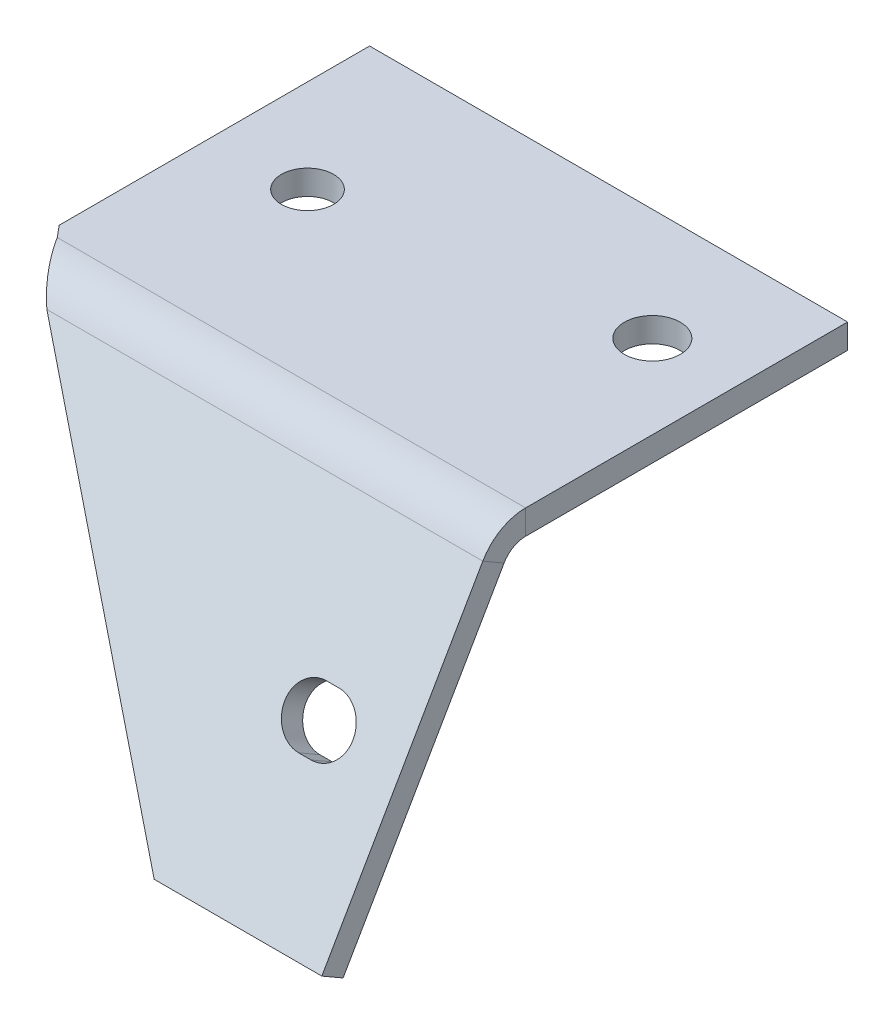
ISO-10303-21;
HEADER;
FILE_DESCRIPTION(('STEP AP214'),'2;1');
FILE_NAME('part.step','',(''),(''),'','','');
FILE_SCHEMA(('AUTOMOTIVE_DESIGN { 1 0 10303 214 1 1 1 1 }'));
ENDSEC;
DATA;
#1=APPLICATION_CONTEXT('core data for automotive mechanical design processes');
#2=APPLICATION_PROTOCOL_DEFINITION('international standard','automotive_design',2000,#1);
#3=PRODUCT_CONTEXT('',#1,'mechanical');
#4=PRODUCT('Part','Part','',(#3));
#5=PRODUCT_RELATED_PRODUCT_CATEGORY('part','',(#4));
#6=PRODUCT_DEFINITION_FORMATION('','',#4);
#7=PRODUCT_DEFINITION_CONTEXT('part definition',#1,'design');
#8=PRODUCT_DEFINITION('design','',#6,#7);
#9=PRODUCT_DEFINITION_SHAPE('','',#8);
#10=(LENGTH_UNIT() NAMED_UNIT(*) SI_UNIT(.MILLI.,.METRE.));
#11=(NAMED_UNIT(*) PLANE_ANGLE_UNIT() SI_UNIT($,.RADIAN.));
#12=(NAMED_UNIT(*) SI_UNIT($,.STERADIAN.) SOLID_ANGLE_UNIT());
#13=UNCERTAINTY_MEASURE_WITH_UNIT(LENGTH_MEASURE(1.E-05),#10,'distance_accuracy_value','');
#14=(GEOMETRIC_REPRESENTATION_CONTEXT(3) GLOBAL_UNCERTAINTY_ASSIGNED_CONTEXT((#13)) GLOBAL_UNIT_ASSIGNED_CONTEXT((#10,
#11,#12)) REPRESENTATION_CONTEXT('',''));
#15=CARTESIAN_POINT('',(0.,0.,0.));
#16=DIRECTION('',(0.,0.,1.));
#17=DIRECTION('',(1.,0.,0.));
#18=AXIS2_PLACEMENT_3D('',#15,#16,#17);
#19=CARTESIAN_POINT('',(0.,12.3561960815317,8.59844059850372));
#20=DIRECTION('',(0.,-0.499999999999998,-0.86602540378444));
#21=DIRECTION('',(0.,0.86602540378444,-0.499999999999998));
#22=AXIS2_PLACEMENT_3D('',#19,#20,#21);
#23=PLANE('',#22);
#24=DIRECTION('',(1.,0.,0.));
#25=VECTOR('',#24,1.);
#26=CARTESIAN_POINT('',(0.,-11.2713846311385,22.2398306832634));
#27=LINE('',#26,#25);
#28=CARTESIAN_POINT('',(12.0250000000008,-11.2713846311385,22.2398306832634));
#29=VERTEX_POINT('',#28);
#30=CARTESIAN_POINT('',(13.0250000000008,-11.2713846311385,22.2398306832634));
#31=VERTEX_POINT('',#30);
#32=EDGE_CURVE('E181',#29,#31,#27,.T.);
#33=ORIENTED_EDGE('',*,*,#32,.T.);
#34=CARTESIAN_POINT('',(13.0250000000008,-13.2199417896535,23.3648306832634));
#35=DIRECTION('',(0.,-0.499999999999998,-0.86602540378444));
#36=DIRECTION('',(0.,0.86602540378444,-0.499999999999998));
#37=AXIS2_PLACEMENT_3D('',#34,#35,#36);
#38=CIRCLE('',#37,2.25);
#39=CARTESIAN_POINT('',(13.0250000000008,-15.1684989481685,24.4898306832634));
#40=VERTEX_POINT('',#39);
#41=EDGE_CURVE('E184',#31,#40,#38,.T.);
#42=ORIENTED_EDGE('',*,*,#41,.T.);
#43=DIRECTION('',(-1.,0.,0.));
#44=VECTOR('',#43,1.);
#45=CARTESIAN_POINT('',(0.,-15.1684989481685,24.4898306832634));
#46=LINE('',#45,#44);
#47=CARTESIAN_POINT('',(12.0250000000008,-15.1684989481685,24.4898306832634));
#48=VERTEX_POINT('',#47);
#49=EDGE_CURVE('E176',#40,#48,#46,.T.);
#50=ORIENTED_EDGE('',*,*,#49,.T.);
#51=CARTESIAN_POINT('',(12.0250000000008,-13.2199417896535,23.3648306832634));
#52=DIRECTION('',(0.,-0.499999999999998,-0.86602540378444));
#53=DIRECTION('',(0.,0.86602540378444,-0.499999999999998));
#54=AXIS2_PLACEMENT_3D('',#51,#52,#53);
#55=CIRCLE('',#54,2.25);
#56=EDGE_CURVE('E156',#48,#29,#55,.T.);
#57=ORIENTED_EDGE('',*,*,#56,.T.);
#58=EDGE_LOOP('',(#33,#42,#50,#57));
#59=FACE_BOUND('',#58,.T.);
#60=DIRECTION('',(0.,0.86602540378444,-0.499999999999998));
#61=VECTOR('',#60,1.);
#62=CARTESIAN_POINT('',(19.25,1.53087853422617,14.8484405985037));
#63=LINE('',#62,#61);
#64=CARTESIAN_POINT('',(19.25,-24.449883579307,29.8484405985036));
#65=VERTEX_POINT('',#64);
#66=CARTESIAN_POINT('',(19.25,-1.99000000000001,16.8812207680231));
#67=VERTEX_POINT('',#66);
#68=EDGE_CURVE('E399',#65,#67,#63,.T.);
#69=ORIENTED_EDGE('',*,*,#68,.T.);
#70=DIRECTION('',(-1.,0.,0.));
#71=VECTOR('',#70,1.);
#72=CARTESIAN_POINT('',(0.,-1.99000000000001,16.8812207680231));
#73=LINE('',#72,#71);
#74=CARTESIAN_POINT('',(-15.8620330508009,-1.99000000000001,16.8812207680231));
#75=VERTEX_POINT('',#74);
#76=EDGE_CURVE('E62',#67,#75,#73,.T.);
#77=ORIENTED_EDGE('',*,*,#76,.T.);
#78=DIRECTION('',(0.64018439966448,-0.665299143859116,0.384110639798686));
#79=VECTOR('',#78,1.);
#80=CARTESIAN_POINT('',(-19.25,1.53087853422617,14.8484405985037));
#81=LINE('',#80,#79);
#82=CARTESIAN_POINT('',(5.75,-24.449883579307,29.8484405985036));
#83=VERTEX_POINT('',#82);
#84=EDGE_CURVE('E288',#75,#83,#81,.T.);
#85=ORIENTED_EDGE('',*,*,#84,.T.);
#86=DIRECTION('',(1.,0.,0.));
#87=VECTOR('',#86,1.);
#88=CARTESIAN_POINT('',(5.75,-24.449883579307,29.8484405985036));
#89=LINE('',#88,#87);
#90=EDGE_CURVE('E387',#83,#65,#89,.T.);
#91=ORIENTED_EDGE('',*,*,#90,.T.);
#92=EDGE_LOOP('',(#69,#77,#85,#91));
#93=FACE_BOUND('',#92,.T.);
#94=ADVANCED_FACE('F53',(#59,#93),#23,.F.);
#95=CARTESIAN_POINT('',(19.25,0.540878534226177,13.1337102990105));
#96=DIRECTION('',(1.,0.,0.));
#97=DIRECTION('',(0.,0.86602540378444,-0.499999999999998));
#98=AXIS2_PLACEMENT_3D('',#95,#96,#97);
#99=PLANE('',#98);
#100=DIRECTION('',(0.,-0.499999999999998,-0.86602540378444));
#101=VECTOR('',#100,1.);
#102=CARTESIAN_POINT('',(19.25,-2.98,15.16649046853));
#103=LINE('',#102,#101);
#104=CARTESIAN_POINT('',(19.25,-2.98,15.16649046853));
#105=VERTEX_POINT('',#104);
#106=EDGE_CURVE('E12',#67,#105,#103,.T.);
#107=ORIENTED_EDGE('',*,*,#106,.F.);
#108=ORIENTED_EDGE('',*,*,#68,.F.);
#109=DIRECTION('',(0.,0.499999999999998,0.86602540378444));
#110=VECTOR('',#109,1.);
#111=CARTESIAN_POINT('',(19.25,-25.439883579307,28.1337102990104));
#112=LINE('',#111,#110);
#113=CARTESIAN_POINT('',(19.25,-25.439883579307,28.1337102990104));
#114=VERTEX_POINT('',#113);
#115=EDGE_CURVE('E393',#114,#65,#112,.T.);
#116=ORIENTED_EDGE('',*,*,#115,.F.);
#117=DIRECTION('',(0.,0.86602540378444,-0.499999999999998));
#118=VECTOR('',#117,1.);
#119=CARTESIAN_POINT('',(19.25,-25.439883579307,28.1337102990104));
#120=LINE('',#119,#118);
#121=EDGE_CURVE('E401',#114,#105,#120,.T.);
#122=ORIENTED_EDGE('',*,*,#121,.T.);
#123=EDGE_LOOP('',(#107,#108,#116,#122));
#124=FACE_BOUND('',#123,.T.);
#125=ADVANCED_FACE('F55',(#124),#99,.T.);
#126=CARTESIAN_POINT('',(5.75,-25.439883579307,28.1337102990104));
#127=DIRECTION('',(0.,-0.86602540378444,0.499999999999998));
#128=DIRECTION('',(1.,0.,0.));
#129=AXIS2_PLACEMENT_3D('',#126,#127,#128);
#130=PLANE('',#129);
#131=ORIENTED_EDGE('',*,*,#90,.F.);
#132=DIRECTION('',(0.,0.499999999999998,0.86602540378444));
#133=VECTOR('',#132,1.);
#134=CARTESIAN_POINT('',(5.75,-25.439883579307,28.1337102990104));
#135=LINE('',#134,#133);
#136=CARTESIAN_POINT('',(5.75,-25.439883579307,28.1337102990104));
#137=VERTEX_POINT('',#136);
#138=EDGE_CURVE('E403',#137,#83,#135,.T.);
#139=ORIENTED_EDGE('',*,*,#138,.F.);
#140=DIRECTION('',(1.,0.,0.));
#141=VECTOR('',#140,1.);
#142=CARTESIAN_POINT('',(5.75,-25.439883579307,28.1337102990104));
#143=LINE('',#142,#141);
#144=EDGE_CURVE('E398',#137,#114,#143,.T.);
#145=ORIENTED_EDGE('',*,*,#144,.T.);
#146=ORIENTED_EDGE('',*,*,#115,.T.);
#147=EDGE_LOOP('',(#131,#139,#145,#146));
#148=FACE_BOUND('',#147,.T.);
#149=ADVANCED_FACE('F360',(#148),#130,.T.);
#150=CARTESIAN_POINT('',(-19.25,0.540878534226177,13.1337102990105));
#151=DIRECTION('',(-0.768221279597376,-0.55441595321593,0.320092199832239));
#152=DIRECTION('',(0.64018439966448,-0.665299143859116,0.384110639798686));
#153=AXIS2_PLACEMENT_3D('',#150,#151,#152);
#154=PLANE('',#153);
#155=CARTESIAN_POINT('',(-15.8620330508009,-2.98,15.16649046853));
#156=CARTESIAN_POINT('',(-15.8620330508009,-1.99000000000001,16.8812207680231));
#157=B_SPLINE_CURVE_WITH_KNOTS('',1,(#155,#156),.UNSPECIFIED.,.F.,.F.,(2,2),(0.,1.),.UNSPECIFIED.);
#158=CARTESIAN_POINT('',(-15.8620330508009,-2.98,15.16649046853));
#159=VERTEX_POINT('',#158);
#160=EDGE_CURVE('E276',#159,#75,#157,.T.);
#161=ORIENTED_EDGE('',*,*,#160,.F.);
#162=DIRECTION('',(0.64018439966448,-0.665299143859116,0.384110639798686));
#163=VECTOR('',#162,1.);
#164=CARTESIAN_POINT('',(-19.25,0.540878534226177,13.1337102990105));
#165=LINE('',#164,#163);
#166=EDGE_CURVE('E396',#159,#137,#165,.T.);
#167=ORIENTED_EDGE('',*,*,#166,.T.);
#168=ORIENTED_EDGE('',*,*,#138,.T.);
#169=ORIENTED_EDGE('',*,*,#84,.F.);
#170=EDGE_LOOP('',(#161,#167,#168,#169));
#171=FACE_BOUND('',#170,.T.);
#172=ADVANCED_FACE('F363',(#171),#154,.T.);
#173=CARTESIAN_POINT('',(0.,11.3661960815317,6.88371029901053));
#174=DIRECTION('',(0.,-0.499999999999998,-0.86602540378444));
#175=DIRECTION('',(0.,0.86602540378444,-0.499999999999998));
#176=AXIS2_PLACEMENT_3D('',#173,#174,#175);
#177=PLANE('',#176);
#178=CARTESIAN_POINT('',(13.0250000000008,-14.2099417896535,21.6501003837702));
#179=DIRECTION('',(0.,-0.499999999999998,-0.86602540378444));
#180=DIRECTION('',(0.,0.86602540378444,-0.499999999999998));
#181=AXIS2_PLACEMENT_3D('',#178,#179,#180);
#182=CIRCLE('',#181,2.25);
#183=CARTESIAN_POINT('',(13.0250000000008,-12.2613846311385,20.5251003837702));
#184=VERTEX_POINT('',#183);
#185=CARTESIAN_POINT('',(13.0250000000008,-16.1584989481685,22.7751003837702));
#186=VERTEX_POINT('',#185);
#187=EDGE_CURVE('E78',#184,#186,#182,.T.);
#188=ORIENTED_EDGE('',*,*,#187,.F.);
#189=DIRECTION('',(1.,0.,0.));
#190=VECTOR('',#189,1.);
#191=CARTESIAN_POINT('',(13.0250000000008,-12.2613846311385,20.5251003837702));
#192=LINE('',#191,#190);
#193=CARTESIAN_POINT('',(12.0250000000008,-12.2613846311385,20.5251003837702));
#194=VERTEX_POINT('',#193);
#195=EDGE_CURVE('E169',#194,#184,#192,.T.);
#196=ORIENTED_EDGE('',*,*,#195,.F.);
#197=CARTESIAN_POINT('',(12.0250000000008,-14.2099417896535,21.6501003837702));
#198=DIRECTION('',(0.,-0.499999999999998,-0.86602540378444));
#199=DIRECTION('',(0.,0.86602540378444,-0.499999999999998));
#200=AXIS2_PLACEMENT_3D('',#197,#198,#199);
#201=CIRCLE('',#200,2.25);
#202=CARTESIAN_POINT('',(12.0250000000008,-16.1584989481685,22.7751003837702));
#203=VERTEX_POINT('',#202);
#204=EDGE_CURVE('E153',#203,#194,#201,.T.);
#205=ORIENTED_EDGE('',*,*,#204,.F.);
#206=DIRECTION('',(-1.,0.,0.));
#207=VECTOR('',#206,1.);
#208=CARTESIAN_POINT('',(13.0250000000008,-16.1584989481685,22.7751003837702));
#209=LINE('',#208,#207);
#210=EDGE_CURVE('E162',#186,#203,#209,.T.);
#211=ORIENTED_EDGE('',*,*,#210,.F.);
#212=EDGE_LOOP('',(#188,#196,#205,#211));
#213=FACE_BOUND('',#212,.T.);
#214=DIRECTION('',(-1.,0.,0.));
#215=VECTOR('',#214,1.);
#216=CARTESIAN_POINT('',(0.,-2.98,15.16649046853));
#217=LINE('',#216,#215);
#218=EDGE_CURVE('E390',#105,#159,#217,.T.);
#219=ORIENTED_EDGE('',*,*,#218,.F.);
#220=ORIENTED_EDGE('',*,*,#121,.F.);
#221=ORIENTED_EDGE('',*,*,#144,.F.);
#222=ORIENTED_EDGE('',*,*,#166,.F.);
#223=EDGE_LOOP('',(#219,#220,#221,#222));
#224=FACE_BOUND('',#223,.T.);
#225=ADVANCED_FACE('F166',(#213,#224),#177,.T.);
#226=CARTESIAN_POINT('',(19.25,-1.98,-12.5));
#227=DIRECTION('',(0.,0.,-1.));
#228=DIRECTION('',(-1.,0.,0.));
#229=AXIS2_PLACEMENT_3D('',#226,#227,#228);
#230=PLANE('',#229);
#231=DIRECTION('',(-1.,0.,0.));
#232=VECTOR('',#231,1.);
#233=CARTESIAN_POINT('',(19.25,0.,-12.5));
#234=LINE('',#233,#232);
#235=CARTESIAN_POINT('',(19.25,0.,-12.5));
#236=VERTEX_POINT('',#235);
#237=CARTESIAN_POINT('',(-19.25,0.,-12.5));
#238=VERTEX_POINT('',#237);
#239=EDGE_CURVE('E301',#236,#238,#234,.T.);
#240=ORIENTED_EDGE('',*,*,#239,.F.);
#241=DIRECTION('',(0.,1.,0.));
#242=VECTOR('',#241,1.);
#243=CARTESIAN_POINT('',(19.25,-1.98,-12.5));
#244=LINE('',#243,#242);
#245=CARTESIAN_POINT('',(19.25,-1.98,-12.5));
#246=VERTEX_POINT('',#245);
#247=EDGE_CURVE('E280',#246,#236,#244,.T.);
#248=ORIENTED_EDGE('',*,*,#247,.F.);
#249=DIRECTION('',(-1.,0.,0.));
#250=VECTOR('',#249,1.);
#251=CARTESIAN_POINT('',(19.25,-1.98,-12.5));
#252=LINE('',#251,#250);
#253=CARTESIAN_POINT('',(-19.25,-1.98,-12.5));
#254=VERTEX_POINT('',#253);
#255=EDGE_CURVE('E318',#246,#254,#252,.T.);
#256=ORIENTED_EDGE('',*,*,#255,.T.);
#257=DIRECTION('',(0.,1.,0.));
#258=VECTOR('',#257,1.);
#259=CARTESIAN_POINT('',(-19.25,-1.98,-12.5));
#260=LINE('',#259,#258);
#261=EDGE_CURVE('E316',#254,#238,#260,.T.);
#262=ORIENTED_EDGE('',*,*,#261,.T.);
#263=EDGE_LOOP('',(#240,#248,#256,#262));
#264=FACE_BOUND('',#263,.T.);
#265=ADVANCED_FACE('F253',(#264),#230,.T.);
#266=CARTESIAN_POINT('',(-19.25,-1.98,12.5));
#267=DIRECTION('',(-1.,0.,0.));
#268=DIRECTION('',(0.,0.,1.));
#269=AXIS2_PLACEMENT_3D('',#266,#267,#268);
#270=PLANE('',#269);
#271=DIRECTION('',(0.,0.,1.));
#272=VECTOR('',#271,1.);
#273=CARTESIAN_POINT('',(-19.25,0.,12.5));
#274=LINE('',#273,#272);
#275=CARTESIAN_POINT('',(-19.25,0.,12.5));
#276=VERTEX_POINT('',#275);
#277=EDGE_CURVE('E298',#238,#276,#274,.T.);
#278=ORIENTED_EDGE('',*,*,#277,.F.);
#279=ORIENTED_EDGE('',*,*,#261,.F.);
#280=DIRECTION('',(0.,0.,1.));
#281=VECTOR('',#280,1.);
#282=CARTESIAN_POINT('',(-19.25,-1.98,12.5));
#283=LINE('',#282,#281);
#284=CARTESIAN_POINT('',(-19.25,-1.98,12.5));
#285=VERTEX_POINT('',#284);
#286=EDGE_CURVE('E313',#254,#285,#283,.T.);
#287=ORIENTED_EDGE('',*,*,#286,.T.);
#288=DIRECTION('',(0.,1.,0.));
#289=VECTOR('',#288,1.);
#290=CARTESIAN_POINT('',(-19.25,-1.98,12.5));
#291=LINE('',#290,#289);
#292=EDGE_CURVE('E311',#285,#276,#291,.T.);
#293=ORIENTED_EDGE('',*,*,#292,.T.);
#294=EDGE_LOOP('',(#278,#279,#287,#293));
#295=FACE_BOUND('',#294,.T.);
#296=ADVANCED_FACE('F577',(#295),#270,.T.);
#297=CARTESIAN_POINT('',(-11.75,8.02,0.));
#298=DIRECTION('',(0.,-1.,0.));
#299=DIRECTION('',(0.,0.,-1.));
#300=AXIS2_PLACEMENT_3D('',#297,#298,#299);
#301=CYLINDRICAL_SURFACE('',#300,2.1);
#302=CARTESIAN_POINT('',(-11.75,-1.98,0.));
#303=DIRECTION('',(0.,-1.,0.));
#304=DIRECTION('',(0.,0.,-1.));
#305=AXIS2_PLACEMENT_3D('',#302,#303,#304);
#306=CIRCLE('',#305,2.1);
#307=CARTESIAN_POINT('',(-11.75,-1.98,-2.1));
#308=VERTEX_POINT('',#307);
#309=EDGE_CURVE('E307',#308,#308,#306,.T.);
#310=ORIENTED_EDGE('',*,*,#309,.T.);
#311=EDGE_LOOP('',(#310));
#312=FACE_BOUND('',#311,.T.);
#313=CARTESIAN_POINT('',(-11.75,0.,0.));
#314=DIRECTION('',(0.,-1.,0.));
#315=DIRECTION('',(0.,0.,-1.));
#316=AXIS2_PLACEMENT_3D('',#313,#314,#315);
#317=CIRCLE('',#316,2.1);
#318=CARTESIAN_POINT('',(-11.75,0.,-2.1));
#319=VERTEX_POINT('',#318);
#320=EDGE_CURVE('E294',#319,#319,#317,.T.);
#321=ORIENTED_EDGE('',*,*,#320,.F.);
#322=EDGE_LOOP('',(#321));
#323=FACE_BOUND('',#322,.T.);
#324=ADVANCED_FACE('F568',(#312,#323),#301,.F.);
#325=CARTESIAN_POINT('',(0.,-1.98,0.));
#326=DIRECTION('',(0.,-1.,0.));
#327=DIRECTION('',(0.,0.,-1.));
#328=AXIS2_PLACEMENT_3D('',#325,#326,#327);
#329=PLANE('',#328);
#330=CARTESIAN_POINT('',(12.5250000000008,-1.98,-3.50000000006401));
#331=DIRECTION('',(0.,-1.,0.));
#332=DIRECTION('',(0.,0.,-1.));
#333=AXIS2_PLACEMENT_3D('',#330,#331,#332);
#334=CIRCLE('',#333,2.25);
#335=CARTESIAN_POINT('',(12.5250000000008,-1.98,-5.75000000006401));
#336=VERTEX_POINT('',#335);
#337=EDGE_CURVE('E187',#336,#336,#334,.T.);
#338=ORIENTED_EDGE('',*,*,#337,.F.);
#339=EDGE_LOOP('',(#338));
#340=FACE_BOUND('',#339,.T.);
#341=ORIENTED_EDGE('',*,*,#309,.F.);
#342=EDGE_LOOP('',(#341));
#343=FACE_BOUND('',#342,.T.);
#344=DIRECTION('',(0.,0.,-1.));
#345=VECTOR('',#344,1.);
#346=CARTESIAN_POINT('',(19.25,-1.98,42.5));
#347=LINE('',#346,#345);
#348=CARTESIAN_POINT('',(19.25,-1.98,13.4344396609611));
#349=VERTEX_POINT('',#348);
#350=EDGE_CURVE('E289',#349,#246,#347,.T.);
#351=ORIENTED_EDGE('',*,*,#350,.F.);
#352=DIRECTION('',(-1.,0.,0.));
#353=VECTOR('',#352,1.);
#354=CARTESIAN_POINT('',(0.,-1.98,13.4344396609611));
#355=LINE('',#354,#353);
#356=CARTESIAN_POINT('',(-18.4713002825324,-1.98,13.4344396609611));
#357=VERTEX_POINT('',#356);
#358=EDGE_CURVE('E310',#349,#357,#355,.T.);
#359=ORIENTED_EDGE('',*,*,#358,.T.);
#360=DIRECTION('',(0.64018439966448,0.,0.768221279597376));
#361=VECTOR('',#360,1.);
#362=CARTESIAN_POINT('',(-19.25,-1.98,12.5));
#363=LINE('',#362,#361);
#364=EDGE_CURVE('E415',#285,#357,#363,.T.);
#365=ORIENTED_EDGE('',*,*,#364,.F.);
#366=ORIENTED_EDGE('',*,*,#286,.F.);
#367=ORIENTED_EDGE('',*,*,#255,.F.);
#368=EDGE_LOOP('',(#351,#359,#365,#366,#367));
#369=FACE_BOUND('',#368,.T.);
#370=ADVANCED_FACE('F351',(#340,#343,#369),#329,.T.);
#371=CARTESIAN_POINT('',(-19.25,-1.98,12.5));
#372=DIRECTION('',(-0.768221279597376,0.,0.64018439966448));
#373=DIRECTION('',(0.64018439966448,0.,0.768221279597376));
#374=AXIS2_PLACEMENT_3D('',#371,#372,#373);
#375=PLANE('',#374);
#376=ORIENTED_EDGE('',*,*,#364,.T.);
#377=CARTESIAN_POINT('',(-18.4713002825324,0.,13.4344396609611));
#378=CARTESIAN_POINT('',(-18.4713002825324,-1.98,13.4344396609611));
#379=B_SPLINE_CURVE_WITH_KNOTS('',1,(#377,#378),.UNSPECIFIED.,.F.,.F.,(2,2),(0.,1.),.UNSPECIFIED.);
#380=CARTESIAN_POINT('',(-18.4713002825324,0.,13.4344396609611));
#381=VERTEX_POINT('',#380);
#382=EDGE_CURVE('E306',#357,#381,#379,.F.);
#383=ORIENTED_EDGE('',*,*,#382,.T.);
#384=DIRECTION('',(0.64018439966448,0.,0.768221279597376));
#385=VECTOR('',#384,1.);
#386=CARTESIAN_POINT('',(-19.25,0.,12.5));
#387=LINE('',#386,#385);
#388=EDGE_CURVE('E297',#276,#381,#387,.T.);
#389=ORIENTED_EDGE('',*,*,#388,.F.);
#390=ORIENTED_EDGE('',*,*,#292,.F.);
#391=EDGE_LOOP('',(#376,#383,#389,#390));
#392=FACE_BOUND('',#391,.T.);
#393=ADVANCED_FACE('F340',(#392),#375,.T.);
#394=CARTESIAN_POINT('',(0.,0.,0.));
#395=DIRECTION('',(0.,-1.,0.));
#396=DIRECTION('',(0.,0.,-1.));
#397=AXIS2_PLACEMENT_3D('',#394,#395,#396);
#398=PLANE('',#397);
#399=CARTESIAN_POINT('',(12.5250000000008,0.,-3.50000000006401));
#400=DIRECTION('',(0.,-1.,0.));
#401=DIRECTION('',(0.,0.,-1.));
#402=AXIS2_PLACEMENT_3D('',#399,#400,#401);
#403=CIRCLE('',#402,2.25);
#404=CARTESIAN_POINT('',(12.5250000000008,0.,-5.75000000006401));
#405=VERTEX_POINT('',#404);
#406=EDGE_CURVE('E57',#405,#405,#403,.T.);
#407=ORIENTED_EDGE('',*,*,#406,.T.);
#408=EDGE_LOOP('',(#407));
#409=FACE_BOUND('',#408,.T.);
#410=DIRECTION('',(-1.,0.,0.));
#411=VECTOR('',#410,1.);
#412=CARTESIAN_POINT('',(0.,0.,13.4344396609611));
#413=LINE('',#412,#411);
#414=CARTESIAN_POINT('',(19.25,0.,13.4344396609611));
#415=VERTEX_POINT('',#414);
#416=EDGE_CURVE('E321',#415,#381,#413,.T.);
#417=ORIENTED_EDGE('',*,*,#416,.F.);
#418=DIRECTION('',(0.,0.,-1.));
#419=VECTOR('',#418,1.);
#420=CARTESIAN_POINT('',(19.25,0.,12.5));
#421=LINE('',#420,#419);
#422=EDGE_CURVE('E304',#415,#236,#421,.T.);
#423=ORIENTED_EDGE('',*,*,#422,.T.);
#424=ORIENTED_EDGE('',*,*,#239,.T.);
#425=ORIENTED_EDGE('',*,*,#277,.T.);
#426=ORIENTED_EDGE('',*,*,#388,.T.);
#427=EDGE_LOOP('',(#417,#423,#424,#425,#426));
#428=FACE_BOUND('',#427,.T.);
#429=ORIENTED_EDGE('',*,*,#320,.T.);
#430=EDGE_LOOP('',(#429));
#431=FACE_BOUND('',#430,.T.);
#432=ADVANCED_FACE('F350',(#409,#428,#431),#398,.F.);
#433=CARTESIAN_POINT('',(19.25,-1.98,12.5));
#434=DIRECTION('',(1.,0.,0.));
#435=DIRECTION('',(0.,0.,-1.));
#436=AXIS2_PLACEMENT_3D('',#433,#434,#435);
#437=PLANE('',#436);
#438=ORIENTED_EDGE('',*,*,#422,.F.);
#439=DIRECTION('',(0.,-1.,0.));
#440=VECTOR('',#439,1.);
#441=CARTESIAN_POINT('',(19.25,-1.98,13.4344396609611));
#442=LINE('',#441,#440);
#443=EDGE_CURVE('E291',#415,#349,#442,.T.);
#444=ORIENTED_EDGE('',*,*,#443,.T.);
#445=ORIENTED_EDGE('',*,*,#350,.T.);
#446=ORIENTED_EDGE('',*,*,#247,.T.);
#447=EDGE_LOOP('',(#438,#444,#445,#446));
#448=FACE_BOUND('',#447,.T.);
#449=ADVANCED_FACE('F355',(#448),#437,.T.);
#450=CARTESIAN_POINT('',(19.25,-3.98,13.4344396609611));
#451=DIRECTION('',(-1.,0.,0.));
#452=DIRECTION('',(0.,0.,1.));
#453=AXIS2_PLACEMENT_3D('',#450,#451,#452);
#454=PLANE('',#453);
#455=ORIENTED_EDGE('',*,*,#443,.F.);
#456=CARTESIAN_POINT('',(19.25,-3.98,13.4344396609611));
#457=DIRECTION('',(-1.,0.,0.));
#458=DIRECTION('',(0.,0.,1.));
#459=AXIS2_PLACEMENT_3D('',#456,#457,#458);
#460=CIRCLE('',#459,3.98);
#461=EDGE_CURVE('E195',#415,#67,#460,.F.);
#462=ORIENTED_EDGE('',*,*,#461,.T.);
#463=ORIENTED_EDGE('',*,*,#106,.T.);
#464=CARTESIAN_POINT('',(19.25,-3.98,13.4344396609611));
#465=DIRECTION('',(1.,0.,0.));
#466=DIRECTION('',(0.,0.,1.));
#467=AXIS2_PLACEMENT_3D('',#464,#465,#466);
#468=CIRCLE('',#467,2.);
#469=EDGE_CURVE('E190',#349,#105,#468,.T.);
#470=ORIENTED_EDGE('',*,*,#469,.F.);
#471=EDGE_LOOP('',(#455,#462,#463,#470));
#472=FACE_BOUND('',#471,.T.);
#473=ADVANCED_FACE('F223',(#472),#454,.F.);
#474=CARTESIAN_POINT('',(-15.8620330508009,-1.99000000000001,16.8812207680231));
#475=CARTESIAN_POINT('',(-16.2970877267354,-1.38817863375923,16.53375904022));
#476=CARTESIAN_POINT('',(-16.7317887947114,-0.88053941408481,16.0260164500988));
#477=CARTESIAN_POINT('',(-17.6015445386219,-0.185898371791064,14.8228628718234));
#478=CARTESIAN_POINT('',(-18.036245606598,0.,14.1293631165674));
#479=CARTESIAN_POINT('',(-18.4713002825324,0.,13.4344396609611));
#480=CARTESIAN_POINT('',(-15.8620330508009,-2.98,15.16649046853));
#481=CARTESIAN_POINT('',(-16.297007352963,-2.67763307371311,14.9919188422442));
#482=CARTESIAN_POINT('',(-16.7317887947114,-2.42248211763056,14.7367395550001));
#483=CARTESIAN_POINT('',(-17.6015445386219,-2.07341626723169,14.132139766922));
#484=CARTESIAN_POINT('',(-18.0363259803704,-1.98,13.7835829135326));
#485=CARTESIAN_POINT('',(-18.4713002825324,-1.98,13.4344396609611));
#486=B_SPLINE_SURFACE_WITH_KNOTS('',1,3,((#474,#475,#476,#477,#478,#479),(#480,#481,#482,#483,
#484,#485)),.UNSPECIFIED.,.F.,.F.,.F.,(2,2),(4,2,4),(0.,1.),(0.,0.5,1.),.UNSPECIFIED.);
#487=CARTESIAN_POINT('',(-15.8620330508009,-1.99000000000001,16.8812207680231));
#488=CARTESIAN_POINT('',(-16.2970877267354,-1.38817863375923,16.53375904022));
#489=CARTESIAN_POINT('',(-16.7317887947114,-0.88053941408481,16.0260164500988));
#490=CARTESIAN_POINT('',(-17.6015445386219,-0.185898371791064,14.8228628718234));
#491=CARTESIAN_POINT('',(-18.036245606598,0.,14.1293631165674));
#492=CARTESIAN_POINT('',(-18.4713002825324,0.,13.4344396609611));
#493=B_SPLINE_CURVE_WITH_KNOTS('',3,(#487,#488,#489,#490,#491,#492),.UNSPECIFIED.,.F.,.F.,(4,2,
4),(0.,0.5,1.),.UNSPECIFIED.);
#494=EDGE_CURVE('E194',#75,#381,#493,.T.);
#495=CARTESIAN_POINT('',(-18.4713002825324,-1.98,13.4344396609611));
#496=CARTESIAN_POINT('',(-18.0363259803704,-1.98,13.7835829135326));
#497=CARTESIAN_POINT('',(-17.6015445386219,-2.07341626723169,14.132139766922));
#498=CARTESIAN_POINT('',(-16.7317887947114,-2.42248211763056,14.7367395550001));
#499=CARTESIAN_POINT('',(-16.297007352963,-2.67763307371311,14.9919188422442));
#500=CARTESIAN_POINT('',(-15.8620330508009,-2.98,15.16649046853));
#501=B_SPLINE_CURVE_WITH_KNOTS('',3,(#495,#496,#497,#498,#499,#500),.UNSPECIFIED.,.F.,.F.,(4,2,
4),(0.,0.5,1.),.UNSPECIFIED.);
#502=EDGE_CURVE('E193',#159,#357,#501,.F.);
#503=ORIENTED_EDGE('',*,*,#494,.T.);
#504=ORIENTED_EDGE('',*,*,#382,.F.);
#505=ORIENTED_EDGE('',*,*,#502,.F.);
#506=ORIENTED_EDGE('',*,*,#160,.T.);
#507=EDGE_LOOP('',(#503,#504,#505,#506));
#508=FACE_BOUND('',#507,.T.);
#509=ADVANCED_FACE('F215',(#508),#486,.F.);
#510=CARTESIAN_POINT('',(38.2921309137655,-3.98,13.4344396609611));
#511=DIRECTION('',(-1.,0.,0.));
#512=DIRECTION('',(0.,0.,1.));
#513=AXIS2_PLACEMENT_3D('',#510,#511,#512);
#514=CYLINDRICAL_SURFACE('',#513,2.);
#515=ORIENTED_EDGE('',*,*,#218,.T.);
#516=ORIENTED_EDGE('',*,*,#502,.T.);
#517=ORIENTED_EDGE('',*,*,#358,.F.);
#518=ORIENTED_EDGE('',*,*,#469,.T.);
#519=EDGE_LOOP('',(#515,#516,#517,#518));
#520=FACE_BOUND('',#519,.T.);
#521=ADVANCED_FACE('F204',(#520),#514,.F.);
#522=CARTESIAN_POINT('',(38.2921309137655,-3.98,13.4344396609611));
#523=DIRECTION('',(-1.,0.,0.));
#524=DIRECTION('',(0.,0.,1.));
#525=AXIS2_PLACEMENT_3D('',#522,#523,#524);
#526=CYLINDRICAL_SURFACE('',#525,3.98);
#527=ORIENTED_EDGE('',*,*,#76,.F.);
#528=ORIENTED_EDGE('',*,*,#461,.F.);
#529=ORIENTED_EDGE('',*,*,#416,.T.);
#530=ORIENTED_EDGE('',*,*,#494,.F.);
#531=EDGE_LOOP('',(#527,#528,#529,#530));
#532=FACE_BOUND('',#531,.T.);
#533=ADVANCED_FACE('F214',(#532),#526,.T.);
#534=CARTESIAN_POINT('',(12.5250000000008,8.02,-3.50000000006401));
#535=DIRECTION('',(0.,-1.,0.));
#536=DIRECTION('',(0.,0.,-1.));
#537=AXIS2_PLACEMENT_3D('',#534,#535,#536);
#538=CYLINDRICAL_SURFACE('',#537,2.25);
#539=ORIENTED_EDGE('',*,*,#337,.T.);
#540=EDGE_LOOP('',(#539));
#541=FACE_BOUND('',#540,.T.);
#542=ORIENTED_EDGE('',*,*,#406,.F.);
#543=EDGE_LOOP('',(#542));
#544=FACE_BOUND('',#543,.T.);
#545=ADVANCED_FACE('F217',(#541,#544),#538,.F.);
#546=CARTESIAN_POINT('',(13.0250000000008,-9.20994178965353,30.3103544216146));
#547=DIRECTION('',(0.,-0.499999999999998,-0.86602540378444));
#548=DIRECTION('',(0.,0.86602540378444,-0.499999999999998));
#549=AXIS2_PLACEMENT_3D('',#546,#547,#548);
#550=CYLINDRICAL_SURFACE('',#549,2.25);
#551=DIRECTION('',(0.,-0.499999999999998,-0.86602540378444));
#552=VECTOR('',#551,1.);
#553=CARTESIAN_POINT('',(13.0250000000008,-7.26138463113854,29.1853544216146));
#554=LINE('',#553,#552);
#555=EDGE_CURVE('E174',#31,#184,#554,.T.);
#556=ORIENTED_EDGE('',*,*,#555,.T.);
#557=ORIENTED_EDGE('',*,*,#187,.T.);
#558=DIRECTION('',(0.,-0.499999999999998,-0.86602540378444));
#559=VECTOR('',#558,1.);
#560=CARTESIAN_POINT('',(13.0250000000008,-11.1584989481685,31.4353544216146));
#561=LINE('',#560,#559);
#562=EDGE_CURVE('E159',#40,#186,#561,.T.);
#563=ORIENTED_EDGE('',*,*,#562,.F.);
#564=ORIENTED_EDGE('',*,*,#41,.F.);
#565=EDGE_LOOP('',(#556,#557,#563,#564));
#566=FACE_BOUND('',#565,.T.);
#567=ADVANCED_FACE('F443',(#566),#550,.F.);
#568=CARTESIAN_POINT('',(13.0250000000008,-7.26138463113854,29.1853544216146));
#569=DIRECTION('',(0.,0.86602540378444,-0.499999999999998));
#570=DIRECTION('',(0.,0.499999999999998,0.86602540378444));
#571=AXIS2_PLACEMENT_3D('',#568,#569,#570);
#572=PLANE('',#571);
#573=DIRECTION('',(0.,-0.499999999999998,-0.86602540378444));
#574=VECTOR('',#573,1.);
#575=CARTESIAN_POINT('',(12.0250000000008,-7.26138463113854,29.1853544216146));
#576=LINE('',#575,#574);
#577=EDGE_CURVE('E158',#29,#194,#576,.T.);
#578=ORIENTED_EDGE('',*,*,#577,.T.);
#579=ORIENTED_EDGE('',*,*,#195,.T.);
#580=ORIENTED_EDGE('',*,*,#555,.F.);
#581=ORIENTED_EDGE('',*,*,#32,.F.);
#582=EDGE_LOOP('',(#578,#579,#580,#581));
#583=FACE_BOUND('',#582,.T.);
#584=ADVANCED_FACE('F442',(#583),#572,.F.);
#585=CARTESIAN_POINT('',(12.0250000000008,-9.20994178965353,30.3103544216146));
#586=DIRECTION('',(0.,-0.499999999999998,-0.86602540378444));
#587=DIRECTION('',(0.,0.86602540378444,-0.499999999999998));
#588=AXIS2_PLACEMENT_3D('',#585,#586,#587);
#589=CYLINDRICAL_SURFACE('',#588,2.25);
#590=DIRECTION('',(0.,-0.499999999999998,-0.86602540378444));
#591=VECTOR('',#590,1.);
#592=CARTESIAN_POINT('',(12.0250000000008,-11.1584989481685,31.4353544216146));
#593=LINE('',#592,#591);
#594=EDGE_CURVE('E70',#48,#203,#593,.T.);
#595=ORIENTED_EDGE('',*,*,#594,.T.);
#596=ORIENTED_EDGE('',*,*,#204,.T.);
#597=ORIENTED_EDGE('',*,*,#577,.F.);
#598=ORIENTED_EDGE('',*,*,#56,.F.);
#599=EDGE_LOOP('',(#595,#596,#597,#598));
#600=FACE_BOUND('',#599,.T.);
#601=ADVANCED_FACE('F150',(#600),#589,.F.);
#602=CARTESIAN_POINT('',(13.0250000000008,-11.1584989481685,31.4353544216146));
#603=DIRECTION('',(0.,-0.86602540378444,0.499999999999998));
#604=DIRECTION('',(0.,-0.499999999999998,-0.86602540378444));
#605=AXIS2_PLACEMENT_3D('',#602,#603,#604);
#606=PLANE('',#605);
#607=ORIENTED_EDGE('',*,*,#562,.T.);
#608=ORIENTED_EDGE('',*,*,#210,.T.);
#609=ORIENTED_EDGE('',*,*,#594,.F.);
#610=ORIENTED_EDGE('',*,*,#49,.F.);
#611=EDGE_LOOP('',(#607,#608,#609,#610));
#612=FACE_BOUND('',#611,.T.);
#613=ADVANCED_FACE('F163',(#612),#606,.F.);
#614=CLOSED_SHELL('',(#94,#125,#149,#172,#225,#265,#296,#324,#370,#393,#432,#449,#473,#509,#521,
#533,#545,#567,#584,#601,#613));
#615=MANIFOLD_SOLID_BREP('B2',#614);
#616=ADVANCED_BREP_SHAPE_REPRESENTATION('',(#18,#615),#14);
#617=SHAPE_DEFINITION_REPRESENTATION(#9,#616);
ENDSEC;
END-ISO-10303-21;
